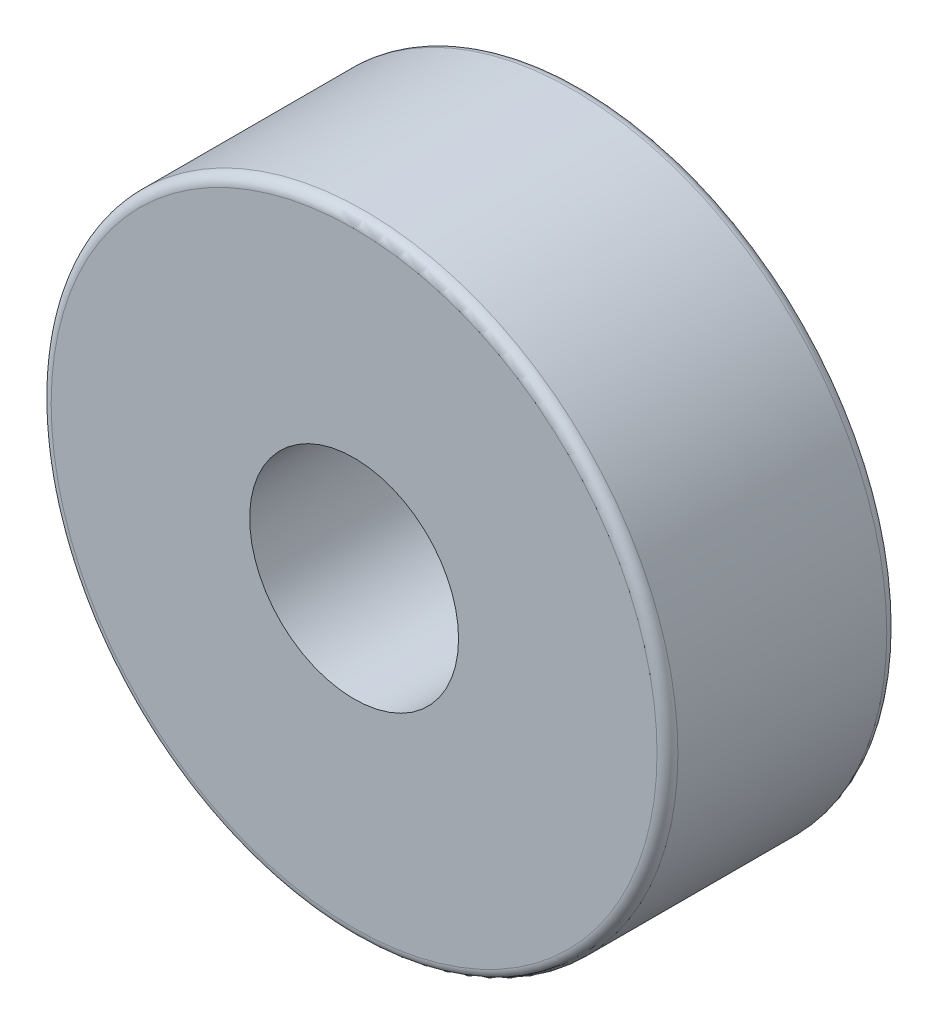
ISO-10303-21;
HEADER;
FILE_DESCRIPTION(('STEP AP214'),'2;1');
FILE_NAME('part.step','',(''),(''),'','','');
FILE_SCHEMA(('AUTOMOTIVE_DESIGN { 1 0 10303 214 1 1 1 1 }'));
ENDSEC;
DATA;
#1=APPLICATION_CONTEXT('core data for automotive mechanical design processes');
#2=APPLICATION_PROTOCOL_DEFINITION('international standard','automotive_design',2000,#1);
#3=PRODUCT_CONTEXT('',#1,'mechanical');
#4=PRODUCT('Part','Part','',(#3));
#5=PRODUCT_RELATED_PRODUCT_CATEGORY('part','',(#4));
#6=PRODUCT_DEFINITION_FORMATION('','',#4);
#7=PRODUCT_DEFINITION_CONTEXT('part definition',#1,'design');
#8=PRODUCT_DEFINITION('design','',#6,#7);
#9=PRODUCT_DEFINITION_SHAPE('','',#8);
#10=(LENGTH_UNIT() NAMED_UNIT(*) SI_UNIT(.MILLI.,.METRE.));
#11=(NAMED_UNIT(*) PLANE_ANGLE_UNIT() SI_UNIT($,.RADIAN.));
#12=(NAMED_UNIT(*) SI_UNIT($,.STERADIAN.) SOLID_ANGLE_UNIT());
#13=UNCERTAINTY_MEASURE_WITH_UNIT(LENGTH_MEASURE(1.E-05),#10,'distance_accuracy_value','');
#14=(GEOMETRIC_REPRESENTATION_CONTEXT(3) GLOBAL_UNCERTAINTY_ASSIGNED_CONTEXT((#13)) GLOBAL_UNIT_ASSIGNED_CONTEXT((#10,
#11,#12)) REPRESENTATION_CONTEXT('',''));
#15=CARTESIAN_POINT('',(0.,0.,0.));
#16=DIRECTION('',(0.,0.,1.));
#17=DIRECTION('',(1.,0.,0.));
#18=AXIS2_PLACEMENT_3D('',#15,#16,#17);
#19=CARTESIAN_POINT('',(0.,0.,22.));
#20=DIRECTION('',(0.,0.,-1.));
#21=DIRECTION('',(-1.,0.,0.));
#22=AXIS2_PLACEMENT_3D('',#19,#20,#21);
#23=CYLINDRICAL_SURFACE('',#22,30.);
#24=CARTESIAN_POINT('',(0.,0.,21.));
#25=DIRECTION('',(0.,0.,1.));
#26=DIRECTION('',(1.,0.,0.));
#27=AXIS2_PLACEMENT_3D('',#24,#25,#26);
#28=CIRCLE('',#27,30.);
#29=CARTESIAN_POINT('',(30.,0.,21.));
#30=VERTEX_POINT('',#29);
#31=EDGE_CURVE('E255',#30,#30,#28,.F.);
#32=ORIENTED_EDGE('',*,*,#31,.T.);
#33=EDGE_LOOP('',(#32));
#34=FACE_BOUND('',#33,.T.);
#35=CARTESIAN_POINT('',(0.,0.,1.));
#36=DIRECTION('',(0.,0.,1.));
#37=DIRECTION('',(1.,0.,0.));
#38=AXIS2_PLACEMENT_3D('',#35,#36,#37);
#39=CIRCLE('',#38,30.);
#40=CARTESIAN_POINT('',(30.,0.,1.));
#41=VERTEX_POINT('',#40);
#42=EDGE_CURVE('E252',#41,#41,#39,.T.);
#43=ORIENTED_EDGE('',*,*,#42,.T.);
#44=EDGE_LOOP('',(#43));
#45=FACE_BOUND('',#44,.T.);
#46=ADVANCED_FACE('F40',(#34,#45),#23,.T.);
#47=CARTESIAN_POINT('',(0.,0.,22.));
#48=DIRECTION('',(0.,0.,1.));
#49=DIRECTION('',(1.,0.,0.));
#50=AXIS2_PLACEMENT_3D('',#47,#48,#49);
#51=PLANE('',#50);
#52=CARTESIAN_POINT('',(0.,0.,22.));
#53=DIRECTION('',(0.,0.,1.));
#54=DIRECTION('',(1.,0.,0.));
#55=AXIS2_PLACEMENT_3D('',#52,#53,#54);
#56=CIRCLE('',#55,29.);
#57=CARTESIAN_POINT('',(29.,0.,22.));
#58=VERTEX_POINT('',#57);
#59=EDGE_CURVE('E249',#58,#58,#56,.T.);
#60=ORIENTED_EDGE('',*,*,#59,.T.);
#61=EDGE_LOOP('',(#60));
#62=FACE_BOUND('',#61,.T.);
#63=CARTESIAN_POINT('',(0.,0.,22.));
#64=DIRECTION('',(0.,0.,1.));
#65=DIRECTION('',(1.,0.,0.));
#66=AXIS2_PLACEMENT_3D('',#63,#64,#65);
#67=CIRCLE('',#66,10.);
#68=CARTESIAN_POINT('',(10.,0.,22.));
#69=VERTEX_POINT('',#68);
#70=EDGE_CURVE('E246',#69,#69,#67,.T.);
#71=ORIENTED_EDGE('',*,*,#70,.F.);
#72=EDGE_LOOP('',(#71));
#73=FACE_BOUND('',#72,.T.);
#74=ADVANCED_FACE('F348',(#62,#73),#51,.T.);
#75=CARTESIAN_POINT('',(0.,0.,0.));
#76=DIRECTION('',(0.,0.,1.));
#77=DIRECTION('',(1.,0.,0.));
#78=AXIS2_PLACEMENT_3D('',#75,#76,#77);
#79=PLANE('',#78);
#80=CARTESIAN_POINT('',(0.,0.,0.));
#81=DIRECTION('',(0.,0.,1.));
#82=DIRECTION('',(1.,0.,0.));
#83=AXIS2_PLACEMENT_3D('',#80,#81,#82);
#84=CIRCLE('',#83,29.);
#85=CARTESIAN_POINT('',(29.,0.,0.));
#86=VERTEX_POINT('',#85);
#87=EDGE_CURVE('E258',#86,#86,#84,.F.);
#88=ORIENTED_EDGE('',*,*,#87,.T.);
#89=EDGE_LOOP('',(#88));
#90=FACE_BOUND('',#89,.T.);
#91=CARTESIAN_POINT('',(0.,0.,0.));
#92=DIRECTION('',(0.,0.,-1.));
#93=DIRECTION('',(-1.,0.,0.));
#94=AXIS2_PLACEMENT_3D('',#91,#92,#93);
#95=CIRCLE('',#94,10.);
#96=CARTESIAN_POINT('',(-9.98749217771908,-0.500000000000007,0.));
#97=VERTEX_POINT('',#96);
#98=CARTESIAN_POINT('',(-9.98749217771908,0.499999999999994,0.));
#99=VERTEX_POINT('',#98);
#100=EDGE_CURVE('E239',#97,#99,#95,.T.);
#101=ORIENTED_EDGE('',*,*,#100,.F.);
#102=DIRECTION('',(1.,0.,0.));
#103=VECTOR('',#102,1.);
#104=CARTESIAN_POINT('',(-3.46410161513777,-0.500000000000007,0.));
#105=LINE('',#104,#103);
#106=CARTESIAN_POINT('',(-24.9949994999,-0.500000000000021,0.));
#107=VERTEX_POINT('',#106);
#108=EDGE_CURVE('E210',#107,#97,#105,.T.);
#109=ORIENTED_EDGE('',*,*,#108,.F.);
#110=CARTESIAN_POINT('',(0.,0.,0.));
#111=DIRECTION('',(0.,0.,-1.));
#112=DIRECTION('',(-1.,0.,0.));
#113=AXIS2_PLACEMENT_3D('',#110,#111,#112);
#114=CIRCLE('',#113,25.);
#115=CARTESIAN_POINT('',(-0.5,-24.9949994999,0.));
#116=VERTEX_POINT('',#115);
#117=EDGE_CURVE('E216',#116,#107,#114,.T.);
#118=ORIENTED_EDGE('',*,*,#117,.F.);
#119=DIRECTION('',(0.,-1.,0.));
#120=VECTOR('',#119,1.);
#121=CARTESIAN_POINT('',(-0.5,-3.46410161513776,0.));
#122=LINE('',#121,#120);
#123=CARTESIAN_POINT('',(-0.499999999999973,-9.98749217771909,0.));
#124=VERTEX_POINT('',#123);
#125=EDGE_CURVE('E214',#124,#116,#122,.T.);
#126=ORIENTED_EDGE('',*,*,#125,.F.);
#127=CARTESIAN_POINT('',(0.5,-9.98749217771909,0.));
#128=VERTEX_POINT('',#127);
#129=EDGE_CURVE('E244',#128,#124,#95,.T.);
#130=ORIENTED_EDGE('',*,*,#129,.F.);
#131=DIRECTION('',(0.,1.,0.));
#132=VECTOR('',#131,1.);
#133=CARTESIAN_POINT('',(0.5,-3.46410161513776,0.));
#134=LINE('',#133,#132);
#135=CARTESIAN_POINT('',(0.5,-24.9949994999,0.));
#136=VERTEX_POINT('',#135);
#137=EDGE_CURVE('E226',#136,#128,#134,.T.);
#138=ORIENTED_EDGE('',*,*,#137,.F.);
#139=CARTESIAN_POINT('',(0.,0.,0.));
#140=DIRECTION('',(0.,0.,-1.));
#141=DIRECTION('',(-1.,0.,0.));
#142=AXIS2_PLACEMENT_3D('',#139,#140,#141);
#143=CIRCLE('',#142,25.);
#144=CARTESIAN_POINT('',(24.9949994999,-0.5,0.));
#145=VERTEX_POINT('',#144);
#146=EDGE_CURVE('E233',#145,#136,#143,.T.);
#147=ORIENTED_EDGE('',*,*,#146,.F.);
#148=DIRECTION('',(1.,0.,0.));
#149=VECTOR('',#148,1.);
#150=CARTESIAN_POINT('',(24.9949994999,-0.5,0.));
#151=LINE('',#150,#149);
#152=CARTESIAN_POINT('',(9.98749217771908,-0.500000000000007,0.));
#153=VERTEX_POINT('',#152);
#154=EDGE_CURVE('E188',#153,#145,#151,.T.);
#155=ORIENTED_EDGE('',*,*,#154,.F.);
#156=CARTESIAN_POINT('',(9.9874921777191,0.499999999999994,0.));
#157=VERTEX_POINT('',#156);
#158=EDGE_CURVE('E315',#157,#153,#95,.T.);
#159=ORIENTED_EDGE('',*,*,#158,.F.);
#160=DIRECTION('',(-1.,0.,0.));
#161=VECTOR('',#160,1.);
#162=CARTESIAN_POINT('',(24.9949994999,0.5,0.));
#163=LINE('',#162,#161);
#164=CARTESIAN_POINT('',(24.9949994999,0.5,0.));
#165=VERTEX_POINT('',#164);
#166=EDGE_CURVE('E200',#165,#157,#163,.T.);
#167=ORIENTED_EDGE('',*,*,#166,.F.);
#168=CARTESIAN_POINT('',(0.,0.,0.));
#169=DIRECTION('',(0.,0.,-1.));
#170=DIRECTION('',(-1.,0.,0.));
#171=AXIS2_PLACEMENT_3D('',#168,#169,#170);
#172=CIRCLE('',#171,25.);
#173=CARTESIAN_POINT('',(0.5,24.9949994999,0.));
#174=VERTEX_POINT('',#173);
#175=EDGE_CURVE('E197',#174,#165,#172,.T.);
#176=ORIENTED_EDGE('',*,*,#175,.F.);
#177=DIRECTION('',(0.,1.,0.));
#178=VECTOR('',#177,1.);
#179=CARTESIAN_POINT('',(0.5,24.9949994999,0.));
#180=LINE('',#179,#178);
#181=CARTESIAN_POINT('',(0.5,9.98749217771908,0.));
#182=VERTEX_POINT('',#181);
#183=EDGE_CURVE('E192',#182,#174,#180,.T.);
#184=ORIENTED_EDGE('',*,*,#183,.F.);
#185=CARTESIAN_POINT('',(-0.5,9.98749217771908,0.));
#186=VERTEX_POINT('',#185);
#187=EDGE_CURVE('E245',#186,#182,#95,.T.);
#188=ORIENTED_EDGE('',*,*,#187,.F.);
#189=DIRECTION('',(0.,-1.,0.));
#190=VECTOR('',#189,1.);
#191=CARTESIAN_POINT('',(-0.5,24.9949994999,0.));
#192=LINE('',#191,#190);
#193=CARTESIAN_POINT('',(-0.5,24.9949994999,0.));
#194=VERTEX_POINT('',#193);
#195=EDGE_CURVE('E181',#194,#186,#192,.T.);
#196=ORIENTED_EDGE('',*,*,#195,.F.);
#197=CARTESIAN_POINT('',(0.,0.,0.));
#198=DIRECTION('',(0.,0.,-1.));
#199=DIRECTION('',(-1.,0.,0.));
#200=AXIS2_PLACEMENT_3D('',#197,#198,#199);
#201=CIRCLE('',#200,25.);
#202=CARTESIAN_POINT('',(-24.9949994999,0.499999999999994,0.));
#203=VERTEX_POINT('',#202);
#204=EDGE_CURVE('E162',#203,#194,#201,.T.);
#205=ORIENTED_EDGE('',*,*,#204,.F.);
#206=DIRECTION('',(-1.,0.,0.));
#207=VECTOR('',#206,1.);
#208=CARTESIAN_POINT('',(-3.46410161513774,0.499999999999994,0.));
#209=LINE('',#208,#207);
#210=EDGE_CURVE('E179',#99,#203,#209,.T.);
#211=ORIENTED_EDGE('',*,*,#210,.F.);
#212=EDGE_LOOP('',(#101,#109,#118,#126,#130,#138,#147,#155,#159,#167,#176,#184,#188,#196,#205,#211));
#213=FACE_BOUND('',#212,.T.);
#214=ADVANCED_FACE('F299',(#90,#213),#79,.F.);
#215=CARTESIAN_POINT('',(0.,0.,66.));
#216=DIRECTION('',(0.,0.,-1.));
#217=DIRECTION('',(-1.,0.,0.));
#218=AXIS2_PLACEMENT_3D('',#215,#216,#217);
#219=CYLINDRICAL_SURFACE('',#218,10.);
#220=CARTESIAN_POINT('',(0.,0.,2.));
#221=DIRECTION('',(0.,0.,-1.));
#222=DIRECTION('',(-1.,0.,0.));
#223=AXIS2_PLACEMENT_3D('',#220,#221,#222);
#224=CIRCLE('',#223,10.);
#225=CARTESIAN_POINT('',(-9.98749217771908,-0.500000000000007,2.));
#226=VERTEX_POINT('',#225);
#227=CARTESIAN_POINT('',(-0.499999999999973,-9.98749217771909,2.));
#228=VERTEX_POINT('',#227);
#229=EDGE_CURVE('E283',#226,#228,#224,.F.);
#230=ORIENTED_EDGE('',*,*,#229,.F.);
#231=DIRECTION('',(0.,0.,-1.));
#232=VECTOR('',#231,1.);
#233=CARTESIAN_POINT('',(-9.98749217771908,-0.500000000000007,66.));
#234=LINE('',#233,#232);
#235=EDGE_CURVE('E11',#226,#97,#234,.T.);
#236=ORIENTED_EDGE('',*,*,#235,.T.);
#237=ORIENTED_EDGE('',*,*,#100,.T.);
#238=DIRECTION('',(0.,0.,-1.));
#239=VECTOR('',#238,1.);
#240=CARTESIAN_POINT('',(-9.98749217771908,0.499999999999994,66.));
#241=LINE('',#240,#239);
#242=CARTESIAN_POINT('',(-9.98749217771908,0.499999999999994,2.));
#243=VERTEX_POINT('',#242);
#244=EDGE_CURVE('E272',#99,#243,#241,.F.);
#245=ORIENTED_EDGE('',*,*,#244,.T.);
#246=CARTESIAN_POINT('',(0.,0.,2.));
#247=DIRECTION('',(0.,0.,-1.));
#248=DIRECTION('',(-1.,0.,0.));
#249=AXIS2_PLACEMENT_3D('',#246,#247,#248);
#250=CIRCLE('',#249,10.);
#251=CARTESIAN_POINT('',(-0.5,9.98749217771908,2.));
#252=VERTEX_POINT('',#251);
#253=EDGE_CURVE('E269',#252,#243,#250,.F.);
#254=ORIENTED_EDGE('',*,*,#253,.F.);
#255=DIRECTION('',(0.,0.,-1.));
#256=VECTOR('',#255,1.);
#257=CARTESIAN_POINT('',(-0.5,9.98749217771908,66.));
#258=LINE('',#257,#256);
#259=EDGE_CURVE('E172',#252,#186,#258,.T.);
#260=ORIENTED_EDGE('',*,*,#259,.T.);
#261=ORIENTED_EDGE('',*,*,#187,.T.);
#262=DIRECTION('',(0.,0.,-1.));
#263=VECTOR('',#262,1.);
#264=CARTESIAN_POINT('',(0.5,9.98749217771908,66.));
#265=LINE('',#264,#263);
#266=CARTESIAN_POINT('',(0.5,9.98749217771908,2.));
#267=VERTEX_POINT('',#266);
#268=EDGE_CURVE('E280',#182,#267,#265,.F.);
#269=ORIENTED_EDGE('',*,*,#268,.T.);
#270=CARTESIAN_POINT('',(0.,0.,2.));
#271=DIRECTION('',(0.,0.,-1.));
#272=DIRECTION('',(-1.,0.,0.));
#273=AXIS2_PLACEMENT_3D('',#270,#271,#272);
#274=CIRCLE('',#273,10.);
#275=CARTESIAN_POINT('',(9.9874921777191,0.499999999999994,2.));
#276=VERTEX_POINT('',#275);
#277=EDGE_CURVE('E275',#276,#267,#274,.F.);
#278=ORIENTED_EDGE('',*,*,#277,.F.);
#279=DIRECTION('',(0.,0.,-1.));
#280=VECTOR('',#279,1.);
#281=CARTESIAN_POINT('',(9.9874921777191,0.499999999999994,66.));
#282=LINE('',#281,#280);
#283=EDGE_CURVE('E277',#276,#157,#282,.T.);
#284=ORIENTED_EDGE('',*,*,#283,.T.);
#285=ORIENTED_EDGE('',*,*,#158,.T.);
#286=DIRECTION('',(0.,0.,-1.));
#287=VECTOR('',#286,1.);
#288=CARTESIAN_POINT('',(9.98749217771908,-0.500000000000007,66.));
#289=LINE('',#288,#287);
#290=CARTESIAN_POINT('',(9.98749217771908,-0.500000000000007,2.));
#291=VERTEX_POINT('',#290);
#292=EDGE_CURVE('E263',#153,#291,#289,.F.);
#293=ORIENTED_EDGE('',*,*,#292,.T.);
#294=CARTESIAN_POINT('',(0.,0.,2.));
#295=DIRECTION('',(0.,0.,-1.));
#296=DIRECTION('',(-1.,0.,0.));
#297=AXIS2_PLACEMENT_3D('',#294,#295,#296);
#298=CIRCLE('',#297,10.);
#299=CARTESIAN_POINT('',(0.5,-9.98749217771909,2.));
#300=VERTEX_POINT('',#299);
#301=EDGE_CURVE('E261',#300,#291,#298,.F.);
#302=ORIENTED_EDGE('',*,*,#301,.F.);
#303=DIRECTION('',(0.,0.,-1.));
#304=VECTOR('',#303,1.);
#305=CARTESIAN_POINT('',(0.5,-9.98749217771909,66.));
#306=LINE('',#305,#304);
#307=EDGE_CURVE('E266',#300,#128,#306,.T.);
#308=ORIENTED_EDGE('',*,*,#307,.T.);
#309=ORIENTED_EDGE('',*,*,#129,.T.);
#310=DIRECTION('',(0.,0.,-1.));
#311=VECTOR('',#310,1.);
#312=CARTESIAN_POINT('',(-0.499999999999973,-9.98749217771909,66.));
#313=LINE('',#312,#311);
#314=EDGE_CURVE('E48',#124,#228,#313,.F.);
#315=ORIENTED_EDGE('',*,*,#314,.T.);
#316=EDGE_LOOP('',(#230,#236,#237,#245,#254,#260,#261,#269,#278,#284,#285,#293,#302,#308,#309,#315));
#317=FACE_BOUND('',#316,.T.);
#318=ORIENTED_EDGE('',*,*,#70,.T.);
#319=EDGE_LOOP('',(#318));
#320=FACE_BOUND('',#319,.T.);
#321=ADVANCED_FACE('F288',(#317,#320),#219,.F.);
#322=CARTESIAN_POINT('',(0.,0.,21.));
#323=DIRECTION('',(0.,0.,1.));
#324=DIRECTION('',(1.,0.,0.));
#325=AXIS2_PLACEMENT_3D('',#322,#323,#324);
#326=TOROIDAL_SURFACE('',#325,29.,1.);
#327=ORIENTED_EDGE('',*,*,#31,.F.);
#328=EDGE_LOOP('',(#327));
#329=FACE_BOUND('',#328,.T.);
#330=ORIENTED_EDGE('',*,*,#59,.F.);
#331=EDGE_LOOP('',(#330));
#332=FACE_BOUND('',#331,.T.);
#333=ADVANCED_FACE('F343',(#329,#332),#326,.T.);
#334=CARTESIAN_POINT('',(0.,0.,1.));
#335=DIRECTION('',(0.,0.,1.));
#336=DIRECTION('',(1.,0.,0.));
#337=AXIS2_PLACEMENT_3D('',#334,#335,#336);
#338=TOROIDAL_SURFACE('',#337,29.,1.);
#339=ORIENTED_EDGE('',*,*,#87,.F.);
#340=EDGE_LOOP('',(#339));
#341=FACE_BOUND('',#340,.T.);
#342=ORIENTED_EDGE('',*,*,#42,.F.);
#343=EDGE_LOOP('',(#342));
#344=FACE_BOUND('',#343,.T.);
#345=ADVANCED_FACE('F42',(#341,#344),#338,.T.);
#346=CARTESIAN_POINT('',(0.5,-3.46410161513776,2.));
#347=DIRECTION('',(-1.,0.,0.));
#348=DIRECTION('',(0.,-1.,0.));
#349=AXIS2_PLACEMENT_3D('',#346,#347,#348);
#350=PLANE('',#349);
#351=DIRECTION('',(0.,1.,0.));
#352=VECTOR('',#351,1.);
#353=CARTESIAN_POINT('',(0.5,-3.46410161513776,2.));
#354=LINE('',#353,#352);
#355=CARTESIAN_POINT('',(0.5,-24.9949994999,2.));
#356=VERTEX_POINT('',#355);
#357=EDGE_CURVE('E229',#356,#300,#354,.T.);
#358=ORIENTED_EDGE('',*,*,#357,.F.);
#359=DIRECTION('',(0.,0.,-1.));
#360=VECTOR('',#359,1.);
#361=CARTESIAN_POINT('',(0.5,-24.9949994999,2.));
#362=LINE('',#361,#360);
#363=EDGE_CURVE('E237',#356,#136,#362,.T.);
#364=ORIENTED_EDGE('',*,*,#363,.T.);
#365=ORIENTED_EDGE('',*,*,#137,.T.);
#366=ORIENTED_EDGE('',*,*,#307,.F.);
#367=EDGE_LOOP('',(#358,#364,#365,#366));
#368=FACE_BOUND('',#367,.T.);
#369=ADVANCED_FACE('F335',(#368),#350,.F.);
#370=CARTESIAN_POINT('',(24.9949994999,-0.5,2.));
#371=DIRECTION('',(0.,1.,0.));
#372=DIRECTION('',(0.,0.,1.));
#373=AXIS2_PLACEMENT_3D('',#370,#371,#372);
#374=PLANE('',#373);
#375=ORIENTED_EDGE('',*,*,#154,.T.);
#376=DIRECTION('',(0.,0.,-1.));
#377=VECTOR('',#376,1.);
#378=CARTESIAN_POINT('',(24.9949994999,-0.5,2.));
#379=LINE('',#378,#377);
#380=CARTESIAN_POINT('',(24.9949994999,-0.5,2.));
#381=VERTEX_POINT('',#380);
#382=EDGE_CURVE('E231',#381,#145,#379,.T.);
#383=ORIENTED_EDGE('',*,*,#382,.F.);
#384=DIRECTION('',(1.,0.,0.));
#385=VECTOR('',#384,1.);
#386=CARTESIAN_POINT('',(24.9949994999,-0.5,2.));
#387=LINE('',#386,#385);
#388=EDGE_CURVE('E223',#291,#381,#387,.T.);
#389=ORIENTED_EDGE('',*,*,#388,.F.);
#390=ORIENTED_EDGE('',*,*,#292,.F.);
#391=EDGE_LOOP('',(#375,#383,#389,#390));
#392=FACE_BOUND('',#391,.T.);
#393=ADVANCED_FACE('F325',(#392),#374,.F.);
#394=CARTESIAN_POINT('',(0.,0.,2.));
#395=DIRECTION('',(0.,0.,-1.));
#396=DIRECTION('',(-1.,0.,0.));
#397=AXIS2_PLACEMENT_3D('',#394,#395,#396);
#398=PLANE('',#397);
#399=ORIENTED_EDGE('',*,*,#301,.T.);
#400=ORIENTED_EDGE('',*,*,#388,.T.);
#401=CARTESIAN_POINT('',(0.,0.,2.));
#402=DIRECTION('',(0.,0.,-1.));
#403=DIRECTION('',(-1.,0.,0.));
#404=AXIS2_PLACEMENT_3D('',#401,#402,#403);
#405=CIRCLE('',#404,25.);
#406=EDGE_CURVE('E225',#381,#356,#405,.T.);
#407=ORIENTED_EDGE('',*,*,#406,.T.);
#408=ORIENTED_EDGE('',*,*,#357,.T.);
#409=EDGE_LOOP('',(#399,#400,#407,#408));
#410=FACE_BOUND('',#409,.T.);
#411=ADVANCED_FACE('F332',(#410),#398,.T.);
#412=CARTESIAN_POINT('',(0.,0.,2.));
#413=DIRECTION('',(0.,0.,-1.));
#414=DIRECTION('',(-1.,0.,0.));
#415=AXIS2_PLACEMENT_3D('',#412,#413,#414);
#416=CYLINDRICAL_SURFACE('',#415,25.);
#417=ORIENTED_EDGE('',*,*,#146,.T.);
#418=ORIENTED_EDGE('',*,*,#363,.F.);
#419=ORIENTED_EDGE('',*,*,#406,.F.);
#420=ORIENTED_EDGE('',*,*,#382,.T.);
#421=EDGE_LOOP('',(#417,#418,#419,#420));
#422=FACE_BOUND('',#421,.T.);
#423=ADVANCED_FACE('F329',(#422),#416,.F.);
#424=CARTESIAN_POINT('',(-3.46410161513774,0.499999999999994,2.));
#425=DIRECTION('',(0.,-1.,0.));
#426=DIRECTION('',(0.,0.,-1.));
#427=AXIS2_PLACEMENT_3D('',#424,#425,#426);
#428=PLANE('',#427);
#429=ORIENTED_EDGE('',*,*,#210,.T.);
#430=DIRECTION('',(0.,0.,-1.));
#431=VECTOR('',#430,1.);
#432=CARTESIAN_POINT('',(-24.9949994999,0.499999999999994,2.));
#433=LINE('',#432,#431);
#434=CARTESIAN_POINT('',(-24.9949994999,0.499999999999994,2.));
#435=VERTEX_POINT('',#434);
#436=EDGE_CURVE('E165',#435,#203,#433,.T.);
#437=ORIENTED_EDGE('',*,*,#436,.F.);
#438=DIRECTION('',(-1.,0.,0.));
#439=VECTOR('',#438,1.);
#440=CARTESIAN_POINT('',(-3.46410161513774,0.499999999999994,2.));
#441=LINE('',#440,#439);
#442=EDGE_CURVE('E166',#243,#435,#441,.T.);
#443=ORIENTED_EDGE('',*,*,#442,.F.);
#444=ORIENTED_EDGE('',*,*,#244,.F.);
#445=EDGE_LOOP('',(#429,#437,#443,#444));
#446=FACE_BOUND('',#445,.T.);
#447=ADVANCED_FACE('F310',(#446),#428,.F.);
#448=CARTESIAN_POINT('',(-0.5,24.9949994999,2.));
#449=DIRECTION('',(1.,0.,0.));
#450=DIRECTION('',(0.,1.,0.));
#451=AXIS2_PLACEMENT_3D('',#448,#449,#450);
#452=PLANE('',#451);
#453=DIRECTION('',(0.,-1.,0.));
#454=VECTOR('',#453,1.);
#455=CARTESIAN_POINT('',(-0.5,24.9949994999,2.));
#456=LINE('',#455,#454);
#457=CARTESIAN_POINT('',(-0.5,24.9949994999,2.));
#458=VERTEX_POINT('',#457);
#459=EDGE_CURVE('E169',#458,#252,#456,.T.);
#460=ORIENTED_EDGE('',*,*,#459,.F.);
#461=DIRECTION('',(0.,0.,-1.));
#462=VECTOR('',#461,1.);
#463=CARTESIAN_POINT('',(-0.5,24.9949994999,2.));
#464=LINE('',#463,#462);
#465=EDGE_CURVE('E155',#458,#194,#464,.T.);
#466=ORIENTED_EDGE('',*,*,#465,.T.);
#467=ORIENTED_EDGE('',*,*,#195,.T.);
#468=ORIENTED_EDGE('',*,*,#259,.F.);
#469=EDGE_LOOP('',(#460,#466,#467,#468));
#470=FACE_BOUND('',#469,.T.);
#471=ADVANCED_FACE('F170',(#470),#452,.F.);
#472=CARTESIAN_POINT('',(0.,0.,2.));
#473=DIRECTION('',(0.,0.,-1.));
#474=DIRECTION('',(-1.,0.,0.));
#475=AXIS2_PLACEMENT_3D('',#472,#473,#474);
#476=PLANE('',#475);
#477=ORIENTED_EDGE('',*,*,#253,.T.);
#478=ORIENTED_EDGE('',*,*,#442,.T.);
#479=CARTESIAN_POINT('',(0.,0.,2.));
#480=DIRECTION('',(0.,0.,-1.));
#481=DIRECTION('',(-1.,0.,0.));
#482=AXIS2_PLACEMENT_3D('',#479,#480,#481);
#483=CIRCLE('',#482,25.);
#484=EDGE_CURVE('E160',#435,#458,#483,.T.);
#485=ORIENTED_EDGE('',*,*,#484,.T.);
#486=ORIENTED_EDGE('',*,*,#459,.T.);
#487=EDGE_LOOP('',(#477,#478,#485,#486));
#488=FACE_BOUND('',#487,.T.);
#489=ADVANCED_FACE('F176',(#488),#476,.T.);
#490=CARTESIAN_POINT('',(0.,0.,2.));
#491=DIRECTION('',(0.,0.,-1.));
#492=DIRECTION('',(-1.,0.,0.));
#493=AXIS2_PLACEMENT_3D('',#490,#491,#492);
#494=CYLINDRICAL_SURFACE('',#493,25.);
#495=ORIENTED_EDGE('',*,*,#204,.T.);
#496=ORIENTED_EDGE('',*,*,#465,.F.);
#497=ORIENTED_EDGE('',*,*,#484,.F.);
#498=ORIENTED_EDGE('',*,*,#436,.T.);
#499=EDGE_LOOP('',(#495,#496,#497,#498));
#500=FACE_BOUND('',#499,.T.);
#501=ADVANCED_FACE('F157',(#500),#494,.F.);
#502=CARTESIAN_POINT('',(0.5,24.9949994999,2.));
#503=DIRECTION('',(-1.,0.,0.));
#504=DIRECTION('',(0.,-1.,0.));
#505=AXIS2_PLACEMENT_3D('',#502,#503,#504);
#506=PLANE('',#505);
#507=ORIENTED_EDGE('',*,*,#183,.T.);
#508=DIRECTION('',(0.,0.,-1.));
#509=VECTOR('',#508,1.);
#510=CARTESIAN_POINT('',(0.5,24.9949994999,2.));
#511=LINE('',#510,#509);
#512=CARTESIAN_POINT('',(0.5,24.9949994999,2.));
#513=VERTEX_POINT('',#512);
#514=EDGE_CURVE('E186',#513,#174,#511,.T.);
#515=ORIENTED_EDGE('',*,*,#514,.F.);
#516=DIRECTION('',(0.,1.,0.));
#517=VECTOR('',#516,1.);
#518=CARTESIAN_POINT('',(0.5,24.9949994999,2.));
#519=LINE('',#518,#517);
#520=EDGE_CURVE('E194',#267,#513,#519,.T.);
#521=ORIENTED_EDGE('',*,*,#520,.F.);
#522=ORIENTED_EDGE('',*,*,#268,.F.);
#523=EDGE_LOOP('',(#507,#515,#521,#522));
#524=FACE_BOUND('',#523,.T.);
#525=ADVANCED_FACE('F398',(#524),#506,.F.);
#526=CARTESIAN_POINT('',(24.9949994999,0.5,2.));
#527=DIRECTION('',(0.,-1.,0.));
#528=DIRECTION('',(0.,0.,-1.));
#529=AXIS2_PLACEMENT_3D('',#526,#527,#528);
#530=PLANE('',#529);
#531=DIRECTION('',(-1.,0.,0.));
#532=VECTOR('',#531,1.);
#533=CARTESIAN_POINT('',(24.9949994999,0.5,2.));
#534=LINE('',#533,#532);
#535=CARTESIAN_POINT('',(24.9949994999,0.5,2.));
#536=VERTEX_POINT('',#535);
#537=EDGE_CURVE('E63',#536,#276,#534,.T.);
#538=ORIENTED_EDGE('',*,*,#537,.F.);
#539=DIRECTION('',(0.,0.,-1.));
#540=VECTOR('',#539,1.);
#541=CARTESIAN_POINT('',(24.9949994999,0.5,2.));
#542=LINE('',#541,#540);
#543=EDGE_CURVE('E196',#536,#165,#542,.T.);
#544=ORIENTED_EDGE('',*,*,#543,.T.);
#545=ORIENTED_EDGE('',*,*,#166,.T.);
#546=ORIENTED_EDGE('',*,*,#283,.F.);
#547=EDGE_LOOP('',(#538,#544,#545,#546));
#548=FACE_BOUND('',#547,.T.);
#549=ADVANCED_FACE('F395',(#548),#530,.F.);
#550=CARTESIAN_POINT('',(0.,0.,2.));
#551=DIRECTION('',(0.,0.,-1.));
#552=DIRECTION('',(-1.,0.,0.));
#553=AXIS2_PLACEMENT_3D('',#550,#551,#552);
#554=PLANE('',#553);
#555=ORIENTED_EDGE('',*,*,#277,.T.);
#556=ORIENTED_EDGE('',*,*,#520,.T.);
#557=CARTESIAN_POINT('',(0.,0.,2.));
#558=DIRECTION('',(0.,0.,-1.));
#559=DIRECTION('',(-1.,0.,0.));
#560=AXIS2_PLACEMENT_3D('',#557,#558,#559);
#561=CIRCLE('',#560,25.);
#562=EDGE_CURVE('E190',#513,#536,#561,.T.);
#563=ORIENTED_EDGE('',*,*,#562,.T.);
#564=ORIENTED_EDGE('',*,*,#537,.T.);
#565=EDGE_LOOP('',(#555,#556,#563,#564));
#566=FACE_BOUND('',#565,.T.);
#567=ADVANCED_FACE('F393',(#566),#554,.T.);
#568=CARTESIAN_POINT('',(0.,0.,2.));
#569=DIRECTION('',(0.,0.,-1.));
#570=DIRECTION('',(-1.,0.,0.));
#571=AXIS2_PLACEMENT_3D('',#568,#569,#570);
#572=CYLINDRICAL_SURFACE('',#571,25.);
#573=ORIENTED_EDGE('',*,*,#175,.T.);
#574=ORIENTED_EDGE('',*,*,#543,.F.);
#575=ORIENTED_EDGE('',*,*,#562,.F.);
#576=ORIENTED_EDGE('',*,*,#514,.T.);
#577=EDGE_LOOP('',(#573,#574,#575,#576));
#578=FACE_BOUND('',#577,.T.);
#579=ADVANCED_FACE('F388',(#578),#572,.F.);
#580=CARTESIAN_POINT('',(-3.46410161513777,-0.500000000000007,2.));
#581=DIRECTION('',(0.,1.,0.));
#582=DIRECTION('',(0.,0.,1.));
#583=AXIS2_PLACEMENT_3D('',#580,#581,#582);
#584=PLANE('',#583);
#585=DIRECTION('',(1.,0.,0.));
#586=VECTOR('',#585,1.);
#587=CARTESIAN_POINT('',(-3.46410161513777,-0.500000000000007,2.));
#588=LINE('',#587,#586);
#589=CARTESIAN_POINT('',(-24.9949994999,-0.500000000000021,2.));
#590=VERTEX_POINT('',#589);
#591=EDGE_CURVE('E55',#590,#226,#588,.T.);
#592=ORIENTED_EDGE('',*,*,#591,.F.);
#593=DIRECTION('',(0.,0.,-1.));
#594=VECTOR('',#593,1.);
#595=CARTESIAN_POINT('',(-24.9949994999,-0.500000000000021,2.));
#596=LINE('',#595,#594);
#597=EDGE_CURVE('E201',#590,#107,#596,.T.);
#598=ORIENTED_EDGE('',*,*,#597,.T.);
#599=ORIENTED_EDGE('',*,*,#108,.T.);
#600=ORIENTED_EDGE('',*,*,#235,.F.);
#601=EDGE_LOOP('',(#592,#598,#599,#600));
#602=FACE_BOUND('',#601,.T.);
#603=ADVANCED_FACE('F307',(#602),#584,.F.);
#604=CARTESIAN_POINT('',(-0.5,-3.46410161513776,2.));
#605=DIRECTION('',(1.,0.,0.));
#606=DIRECTION('',(0.,1.,0.));
#607=AXIS2_PLACEMENT_3D('',#604,#605,#606);
#608=PLANE('',#607);
#609=ORIENTED_EDGE('',*,*,#125,.T.);
#610=DIRECTION('',(0.,0.,-1.));
#611=VECTOR('',#610,1.);
#612=CARTESIAN_POINT('',(-0.5,-24.9949994999,2.));
#613=LINE('',#612,#611);
#614=CARTESIAN_POINT('',(-0.5,-24.9949994999,2.));
#615=VERTEX_POINT('',#614);
#616=EDGE_CURVE('E213',#615,#116,#613,.T.);
#617=ORIENTED_EDGE('',*,*,#616,.F.);
#618=DIRECTION('',(0.,-1.,0.));
#619=VECTOR('',#618,1.);
#620=CARTESIAN_POINT('',(-0.5,-3.46410161513776,2.));
#621=LINE('',#620,#619);
#622=EDGE_CURVE('E207',#228,#615,#621,.T.);
#623=ORIENTED_EDGE('',*,*,#622,.F.);
#624=ORIENTED_EDGE('',*,*,#314,.F.);
#625=EDGE_LOOP('',(#609,#617,#623,#624));
#626=FACE_BOUND('',#625,.T.);
#627=ADVANCED_FACE('F294',(#626),#608,.F.);
#628=CARTESIAN_POINT('',(0.,0.,2.));
#629=DIRECTION('',(0.,0.,-1.));
#630=DIRECTION('',(-1.,0.,0.));
#631=AXIS2_PLACEMENT_3D('',#628,#629,#630);
#632=PLANE('',#631);
#633=ORIENTED_EDGE('',*,*,#229,.T.);
#634=ORIENTED_EDGE('',*,*,#622,.T.);
#635=CARTESIAN_POINT('',(0.,0.,2.));
#636=DIRECTION('',(0.,0.,-1.));
#637=DIRECTION('',(-1.,0.,0.));
#638=AXIS2_PLACEMENT_3D('',#635,#636,#637);
#639=CIRCLE('',#638,25.);
#640=EDGE_CURVE('E209',#615,#590,#639,.T.);
#641=ORIENTED_EDGE('',*,*,#640,.T.);
#642=ORIENTED_EDGE('',*,*,#591,.T.);
#643=EDGE_LOOP('',(#633,#634,#641,#642));
#644=FACE_BOUND('',#643,.T.);
#645=ADVANCED_FACE('F305',(#644),#632,.T.);
#646=CARTESIAN_POINT('',(0.,0.,2.));
#647=DIRECTION('',(0.,0.,-1.));
#648=DIRECTION('',(-1.,0.,0.));
#649=AXIS2_PLACEMENT_3D('',#646,#647,#648);
#650=CYLINDRICAL_SURFACE('',#649,25.);
#651=ORIENTED_EDGE('',*,*,#117,.T.);
#652=ORIENTED_EDGE('',*,*,#597,.F.);
#653=ORIENTED_EDGE('',*,*,#640,.F.);
#654=ORIENTED_EDGE('',*,*,#616,.T.);
#655=EDGE_LOOP('',(#651,#652,#653,#654));
#656=FACE_BOUND('',#655,.T.);
#657=ADVANCED_FACE('F303',(#656),#650,.F.);
#658=CLOSED_SHELL('',(#46,#74,#214,#321,#333,#345,#369,#393,#411,#423,#447,#471,#489,#501,#525,
#549,#567,#579,#603,#627,#645,#657));
#659=MANIFOLD_SOLID_BREP('B2',#658);
#660=ADVANCED_BREP_SHAPE_REPRESENTATION('',(#18,#659),#14);
#661=SHAPE_DEFINITION_REPRESENTATION(#9,#660);
ENDSEC;
END-ISO-10303-21;
